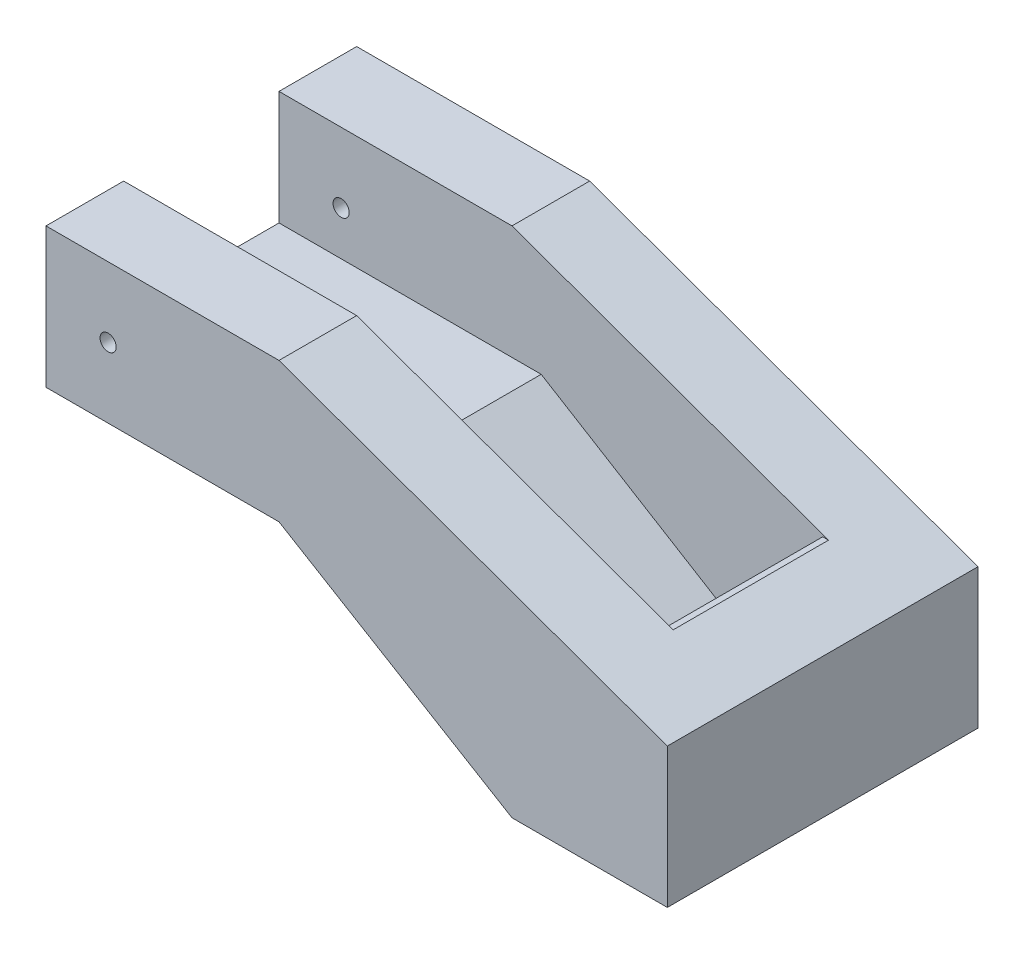
ISO-10303-21;
HEADER;
FILE_DESCRIPTION(('STEP AP214'),'2;1');
FILE_NAME('part.step','',(''),(''),'','','');
FILE_SCHEMA(('AUTOMOTIVE_DESIGN { 1 0 10303 214 1 1 1 1 }'));
ENDSEC;
DATA;
#1=APPLICATION_CONTEXT('core data for automotive mechanical design processes');
#2=APPLICATION_PROTOCOL_DEFINITION('international standard','automotive_design',2000,#1);
#3=PRODUCT_CONTEXT('',#1,'mechanical');
#4=PRODUCT('Part','Part','',(#3));
#5=PRODUCT_RELATED_PRODUCT_CATEGORY('part','',(#4));
#6=PRODUCT_DEFINITION_FORMATION('','',#4);
#7=PRODUCT_DEFINITION_CONTEXT('part definition',#1,'design');
#8=PRODUCT_DEFINITION('design','',#6,#7);
#9=PRODUCT_DEFINITION_SHAPE('','',#8);
#10=(LENGTH_UNIT() NAMED_UNIT(*) SI_UNIT(.MILLI.,.METRE.));
#11=(NAMED_UNIT(*) PLANE_ANGLE_UNIT() SI_UNIT($,.RADIAN.));
#12=(NAMED_UNIT(*) SI_UNIT($,.STERADIAN.) SOLID_ANGLE_UNIT());
#13=UNCERTAINTY_MEASURE_WITH_UNIT(LENGTH_MEASURE(1.E-05),#10,'distance_accuracy_value','');
#14=(GEOMETRIC_REPRESENTATION_CONTEXT(3) GLOBAL_UNCERTAINTY_ASSIGNED_CONTEXT((#13)) GLOBAL_UNIT_ASSIGNED_CONTEXT((#10,
#11,#12)) REPRESENTATION_CONTEXT('',''));
#15=CARTESIAN_POINT('',(0.,0.,0.));
#16=DIRECTION('',(0.,0.,1.));
#17=DIRECTION('',(1.,0.,0.));
#18=AXIS2_PLACEMENT_3D('',#15,#16,#17);
#19=CARTESIAN_POINT('',(127.,-80.4542904682652,190.5));
#20=DIRECTION('',(0.,-1.,0.));
#21=DIRECTION('',(1.,0.,0.));
#22=AXIS2_PLACEMENT_3D('',#19,#20,#21);
#23=PLANE('',#22);
#24=DIRECTION('',(0.,0.,-1.));
#25=VECTOR('',#24,1.);
#26=CARTESIAN_POINT('',(190.5,-80.4542904682652,190.5));
#27=LINE('',#26,#25);
#28=CARTESIAN_POINT('',(190.5,-80.4542904682652,190.5));
#29=VERTEX_POINT('',#28);
#30=CARTESIAN_POINT('',(190.5,-80.4542904682652,63.5));
#31=VERTEX_POINT('',#30);
#32=EDGE_CURVE('E283',#29,#31,#27,.T.);
#33=ORIENTED_EDGE('',*,*,#32,.T.);
#34=DIRECTION('',(1.,0.,0.));
#35=VECTOR('',#34,1.);
#36=CARTESIAN_POINT('',(127.,-80.4542904682652,63.5));
#37=LINE('',#36,#35);
#38=CARTESIAN_POINT('',(127.,-80.4542904682652,63.5));
#39=VERTEX_POINT('',#38);
#40=EDGE_CURVE('E248',#39,#31,#37,.T.);
#41=ORIENTED_EDGE('',*,*,#40,.F.);
#42=DIRECTION('',(0.,0.,-1.));
#43=VECTOR('',#42,1.);
#44=CARTESIAN_POINT('',(127.,-80.4542904682652,190.5));
#45=LINE('',#44,#43);
#46=CARTESIAN_POINT('',(127.,-80.4542904682652,190.5));
#47=VERTEX_POINT('',#46);
#48=EDGE_CURVE('E314',#47,#39,#45,.T.);
#49=ORIENTED_EDGE('',*,*,#48,.F.);
#50=DIRECTION('',(1.,0.,0.));
#51=VECTOR('',#50,1.);
#52=CARTESIAN_POINT('',(127.,-80.4542904682652,190.5));
#53=LINE('',#52,#51);
#54=EDGE_CURVE('E317',#47,#29,#53,.T.);
#55=ORIENTED_EDGE('',*,*,#54,.T.);
#56=EDGE_LOOP('',(#33,#41,#49,#55));
#57=FACE_BOUND('',#56,.T.);
#58=ADVANCED_FACE('F48',(#57),#23,.F.);
#59=CARTESIAN_POINT('',(-254.,114.3,254.));
#60=DIRECTION('',(1.,0.,0.));
#61=DIRECTION('',(0.,1.,0.));
#62=AXIS2_PLACEMENT_3D('',#59,#60,#61);
#63=PLANE('',#62);
#64=DIRECTION('',(0.,0.,1.));
#65=VECTOR('',#64,1.);
#66=CARTESIAN_POINT('',(-254.,0.,0.));
#67=LINE('',#66,#65);
#68=CARTESIAN_POINT('',(-254.,0.,0.));
#69=VERTEX_POINT('',#68);
#70=CARTESIAN_POINT('',(-254.,0.,254.));
#71=VERTEX_POINT('',#70);
#72=EDGE_CURVE('E251',#69,#71,#67,.T.);
#73=ORIENTED_EDGE('',*,*,#72,.T.);
#74=DIRECTION('',(0.,-1.,0.));
#75=VECTOR('',#74,1.);
#76=CARTESIAN_POINT('',(-254.,114.3,254.));
#77=LINE('',#76,#75);
#78=CARTESIAN_POINT('',(-254.,114.3,254.));
#79=VERTEX_POINT('',#78);
#80=EDGE_CURVE('E190',#79,#71,#77,.T.);
#81=ORIENTED_EDGE('',*,*,#80,.F.);
#82=DIRECTION('',(0.,0.,-1.));
#83=VECTOR('',#82,1.);
#84=CARTESIAN_POINT('',(-254.,114.3,254.));
#85=LINE('',#84,#83);
#86=CARTESIAN_POINT('',(-254.,114.3,190.5));
#87=VERTEX_POINT('',#86);
#88=EDGE_CURVE('E57',#79,#87,#85,.T.);
#89=ORIENTED_EDGE('',*,*,#88,.T.);
#90=DIRECTION('',(0.,1.,0.));
#91=VECTOR('',#90,1.);
#92=CARTESIAN_POINT('',(-254.,114.3,190.5));
#93=LINE('',#92,#91);
#94=CARTESIAN_POINT('',(-254.,21.1457095317347,190.5));
#95=VERTEX_POINT('',#94);
#96=EDGE_CURVE('E258',#95,#87,#93,.T.);
#97=ORIENTED_EDGE('',*,*,#96,.F.);
#98=DIRECTION('',(0.,0.,1.));
#99=VECTOR('',#98,1.);
#100=CARTESIAN_POINT('',(-254.,21.1457095317347,63.5));
#101=LINE('',#100,#99);
#102=CARTESIAN_POINT('',(-254.,21.1457095317347,63.5));
#103=VERTEX_POINT('',#102);
#104=EDGE_CURVE('E255',#103,#95,#101,.T.);
#105=ORIENTED_EDGE('',*,*,#104,.F.);
#106=DIRECTION('',(0.,-1.,0.));
#107=VECTOR('',#106,1.);
#108=CARTESIAN_POINT('',(-254.,114.3,63.5));
#109=LINE('',#108,#107);
#110=CARTESIAN_POINT('',(-254.,114.3,63.5));
#111=VERTEX_POINT('',#110);
#112=EDGE_CURVE('E223',#111,#103,#109,.T.);
#113=ORIENTED_EDGE('',*,*,#112,.F.);
#114=CARTESIAN_POINT('',(-254.,114.3,0.));
#115=VERTEX_POINT('',#114);
#116=EDGE_CURVE('E212',#111,#115,#85,.T.);
#117=ORIENTED_EDGE('',*,*,#116,.T.);
#118=DIRECTION('',(0.,-1.,0.));
#119=VECTOR('',#118,1.);
#120=CARTESIAN_POINT('',(-254.,114.3,0.));
#121=LINE('',#120,#119);
#122=EDGE_CURVE('E206',#115,#69,#121,.T.);
#123=ORIENTED_EDGE('',*,*,#122,.T.);
#124=EDGE_LOOP('',(#73,#81,#89,#97,#105,#113,#117,#123));
#125=FACE_BOUND('',#124,.T.);
#126=ADVANCED_FACE('F220',(#125),#63,.F.);
#127=CARTESIAN_POINT('',(0.,0.,254.));
#128=DIRECTION('',(0.,0.,1.));
#129=DIRECTION('',(1.,0.,0.));
#130=AXIS2_PLACEMENT_3D('',#127,#128,#129);
#131=PLANE('',#130);
#132=CARTESIAN_POINT('',(-203.2,57.1500000000001,254.));
#133=DIRECTION('',(0.,0.,1.));
#134=DIRECTION('',(1.,0.,0.));
#135=AXIS2_PLACEMENT_3D('',#132,#133,#134);
#136=CIRCLE('',#135,6.604);
#137=CARTESIAN_POINT('',(-196.596,57.1500000000001,254.));
#138=VERTEX_POINT('',#137);
#139=EDGE_CURVE('E452',#138,#138,#136,.T.);
#140=ORIENTED_EDGE('',*,*,#139,.F.);
#141=EDGE_LOOP('',(#140));
#142=FACE_BOUND('',#141,.T.);
#143=DIRECTION('',(0.940887411868727,-0.338719468272742,0.));
#144=VECTOR('',#143,1.);
#145=CARTESIAN_POINT('',(29.1416430594901,80.9490084985836,254.));
#146=LINE('',#145,#144);
#147=CARTESIAN_POINT('',(-63.5000000000001,114.3,254.));
#148=VERTEX_POINT('',#147);
#149=CARTESIAN_POINT('',(254.,0.,254.));
#150=VERTEX_POINT('',#149);
#151=EDGE_CURVE('E169',#148,#150,#146,.T.);
#152=ORIENTED_EDGE('',*,*,#151,.F.);
#153=DIRECTION('',(-1.,0.,0.));
#154=VECTOR('',#153,1.);
#155=CARTESIAN_POINT('',(-254.,114.3,254.));
#156=LINE('',#155,#154);
#157=EDGE_CURVE('E181',#148,#79,#156,.T.);
#158=ORIENTED_EDGE('',*,*,#157,.T.);
#159=ORIENTED_EDGE('',*,*,#80,.T.);
#160=DIRECTION('',(1.,0.,0.));
#161=VECTOR('',#160,1.);
#162=CARTESIAN_POINT('',(0.,0.,254.));
#163=LINE('',#162,#161);
#164=CARTESIAN_POINT('',(-63.5000000000001,0.,254.));
#165=VERTEX_POINT('',#164);
#166=EDGE_CURVE('E241',#71,#165,#163,.T.);
#167=ORIENTED_EDGE('',*,*,#166,.T.);
#168=DIRECTION('',(-0.857492925712544,0.514495755427526,0.));
#169=VECTOR('',#168,1.);
#170=CARTESIAN_POINT('',(-16.8088235294118,-28.0147058823529,254.));
#171=LINE('',#170,#169);
#172=CARTESIAN_POINT('',(127.,-114.3,254.));
#173=VERTEX_POINT('',#172);
#174=EDGE_CURVE('E245',#173,#165,#171,.T.);
#175=ORIENTED_EDGE('',*,*,#174,.F.);
#176=DIRECTION('',(1.,0.,0.));
#177=VECTOR('',#176,1.);
#178=CARTESIAN_POINT('',(-254.,-114.3,254.));
#179=LINE('',#178,#177);
#180=CARTESIAN_POINT('',(254.,-114.3,254.));
#181=VERTEX_POINT('',#180);
#182=EDGE_CURVE('E192',#173,#181,#179,.T.);
#183=ORIENTED_EDGE('',*,*,#182,.T.);
#184=DIRECTION('',(0.,1.,0.));
#185=VECTOR('',#184,1.);
#186=CARTESIAN_POINT('',(254.,114.3,254.));
#187=LINE('',#186,#185);
#188=EDGE_CURVE('E184',#181,#150,#187,.T.);
#189=ORIENTED_EDGE('',*,*,#188,.T.);
#190=EDGE_LOOP('',(#152,#158,#159,#167,#175,#183,#189));
#191=FACE_BOUND('',#190,.T.);
#192=ADVANCED_FACE('F179',(#142,#191),#131,.T.);
#193=CARTESIAN_POINT('',(0.,0.,0.));
#194=DIRECTION('',(0.,0.,1.));
#195=DIRECTION('',(1.,0.,0.));
#196=AXIS2_PLACEMENT_3D('',#193,#194,#195);
#197=PLANE('',#196);
#198=CARTESIAN_POINT('',(-203.2,57.1500000000001,0.));
#199=DIRECTION('',(0.,0.,1.));
#200=DIRECTION('',(1.,0.,0.));
#201=AXIS2_PLACEMENT_3D('',#198,#199,#200);
#202=CIRCLE('',#201,6.604);
#203=CARTESIAN_POINT('',(-196.596,57.1500000000001,0.));
#204=VERTEX_POINT('',#203);
#205=EDGE_CURVE('E185',#204,#204,#202,.T.);
#206=ORIENTED_EDGE('',*,*,#205,.T.);
#207=EDGE_LOOP('',(#206));
#208=FACE_BOUND('',#207,.T.);
#209=DIRECTION('',(-1.,0.,0.));
#210=VECTOR('',#209,1.);
#211=CARTESIAN_POINT('',(-254.,114.3,0.));
#212=LINE('',#211,#210);
#213=CARTESIAN_POINT('',(-63.5000000000001,114.3,0.));
#214=VERTEX_POINT('',#213);
#215=EDGE_CURVE('E203',#214,#115,#212,.T.);
#216=ORIENTED_EDGE('',*,*,#215,.F.);
#217=DIRECTION('',(0.940887411868727,-0.338719468272742,0.));
#218=VECTOR('',#217,1.);
#219=CARTESIAN_POINT('',(29.1416430594901,80.9490084985836,0.));
#220=LINE('',#219,#218);
#221=CARTESIAN_POINT('',(254.,0.,0.));
#222=VERTEX_POINT('',#221);
#223=EDGE_CURVE('E279',#214,#222,#220,.T.);
#224=ORIENTED_EDGE('',*,*,#223,.T.);
#225=DIRECTION('',(0.,1.,0.));
#226=VECTOR('',#225,1.);
#227=CARTESIAN_POINT('',(254.,114.3,0.));
#228=LINE('',#227,#226);
#229=CARTESIAN_POINT('',(254.,-114.3,0.));
#230=VERTEX_POINT('',#229);
#231=EDGE_CURVE('E200',#230,#222,#228,.T.);
#232=ORIENTED_EDGE('',*,*,#231,.F.);
#233=DIRECTION('',(1.,0.,0.));
#234=VECTOR('',#233,1.);
#235=CARTESIAN_POINT('',(-254.,-114.3,0.));
#236=LINE('',#235,#234);
#237=CARTESIAN_POINT('',(127.,-114.3,0.));
#238=VERTEX_POINT('',#237);
#239=EDGE_CURVE('E194',#238,#230,#236,.T.);
#240=ORIENTED_EDGE('',*,*,#239,.F.);
#241=DIRECTION('',(-0.857492925712544,0.514495755427526,0.));
#242=VECTOR('',#241,1.);
#243=CARTESIAN_POINT('',(-16.8088235294118,-28.0147058823529,0.));
#244=LINE('',#243,#242);
#245=CARTESIAN_POINT('',(-63.5000000000001,0.,0.));
#246=VERTEX_POINT('',#245);
#247=EDGE_CURVE('E235',#238,#246,#244,.T.);
#248=ORIENTED_EDGE('',*,*,#247,.T.);
#249=DIRECTION('',(1.,0.,0.));
#250=VECTOR('',#249,1.);
#251=CARTESIAN_POINT('',(0.,0.,0.));
#252=LINE('',#251,#250);
#253=EDGE_CURVE('E233',#69,#246,#252,.T.);
#254=ORIENTED_EDGE('',*,*,#253,.F.);
#255=ORIENTED_EDGE('',*,*,#122,.F.);
#256=EDGE_LOOP('',(#216,#224,#232,#240,#248,#254,#255));
#257=FACE_BOUND('',#256,.T.);
#258=ADVANCED_FACE('F229',(#208,#257),#197,.F.);
#259=CARTESIAN_POINT('',(-254.,114.3,254.));
#260=DIRECTION('',(0.,-1.,0.));
#261=DIRECTION('',(0.,0.,-1.));
#262=AXIS2_PLACEMENT_3D('',#259,#260,#261);
#263=PLANE('',#262);
#264=ORIENTED_EDGE('',*,*,#157,.F.);
#265=DIRECTION('',(0.,0.,1.));
#266=VECTOR('',#265,1.);
#267=CARTESIAN_POINT('',(-63.5000000000001,114.3,-61.9760000000002));
#268=LINE('',#267,#266);
#269=CARTESIAN_POINT('',(-63.5000000000001,114.3,190.5));
#270=VERTEX_POINT('',#269);
#271=EDGE_CURVE('E166',#270,#148,#268,.T.);
#272=ORIENTED_EDGE('',*,*,#271,.F.);
#273=DIRECTION('',(-1.,0.,0.));
#274=VECTOR('',#273,1.);
#275=CARTESIAN_POINT('',(254.,114.3,190.5));
#276=LINE('',#275,#274);
#277=EDGE_CURVE('E204',#270,#87,#276,.T.);
#278=ORIENTED_EDGE('',*,*,#277,.T.);
#279=ORIENTED_EDGE('',*,*,#88,.F.);
#280=EDGE_LOOP('',(#264,#272,#278,#279));
#281=FACE_BOUND('',#280,.T.);
#282=ADVANCED_FACE('F187',(#281),#263,.F.);
#283=CARTESIAN_POINT('',(254.,114.3,254.));
#284=DIRECTION('',(-1.,0.,0.));
#285=DIRECTION('',(0.,-1.,0.));
#286=AXIS2_PLACEMENT_3D('',#283,#284,#285);
#287=PLANE('',#286);
#288=ORIENTED_EDGE('',*,*,#231,.T.);
#289=DIRECTION('',(0.,0.,1.));
#290=VECTOR('',#289,1.);
#291=CARTESIAN_POINT('',(254.,0.,-61.9760000000002));
#292=LINE('',#291,#290);
#293=EDGE_CURVE('E274',#222,#150,#292,.T.);
#294=ORIENTED_EDGE('',*,*,#293,.T.);
#295=ORIENTED_EDGE('',*,*,#188,.F.);
#296=DIRECTION('',(0.,0.,-1.));
#297=VECTOR('',#296,1.);
#298=CARTESIAN_POINT('',(254.,-114.3,254.));
#299=LINE('',#298,#297);
#300=EDGE_CURVE('E199',#181,#230,#299,.T.);
#301=ORIENTED_EDGE('',*,*,#300,.T.);
#302=EDGE_LOOP('',(#288,#294,#295,#301));
#303=FACE_BOUND('',#302,.T.);
#304=ADVANCED_FACE('F50',(#303),#287,.F.);
#305=DIRECTION('',(-1.,0.,0.));
#306=VECTOR('',#305,1.);
#307=CARTESIAN_POINT('',(254.,114.3,63.5));
#308=LINE('',#307,#306);
#309=CARTESIAN_POINT('',(-63.5000000000001,114.3,63.5));
#310=VERTEX_POINT('',#309);
#311=EDGE_CURVE('E261',#310,#111,#308,.T.);
#312=ORIENTED_EDGE('',*,*,#311,.F.);
#313=EDGE_CURVE('E175',#214,#310,#268,.T.);
#314=ORIENTED_EDGE('',*,*,#313,.F.);
#315=ORIENTED_EDGE('',*,*,#215,.T.);
#316=ORIENTED_EDGE('',*,*,#116,.F.);
#317=EDGE_LOOP('',(#312,#314,#315,#316));
#318=FACE_BOUND('',#317,.T.);
#319=ADVANCED_FACE('F273',(#318),#263,.F.);
#320=CARTESIAN_POINT('',(-254.,-114.3,254.));
#321=DIRECTION('',(0.,1.,0.));
#322=DIRECTION('',(0.,0.,1.));
#323=AXIS2_PLACEMENT_3D('',#320,#321,#322);
#324=PLANE('',#323);
#325=ORIENTED_EDGE('',*,*,#182,.F.);
#326=DIRECTION('',(0.,0.,1.));
#327=VECTOR('',#326,1.);
#328=CARTESIAN_POINT('',(127.,-114.3,0.));
#329=LINE('',#328,#327);
#330=EDGE_CURVE('E237',#238,#173,#329,.T.);
#331=ORIENTED_EDGE('',*,*,#330,.F.);
#332=ORIENTED_EDGE('',*,*,#239,.T.);
#333=ORIENTED_EDGE('',*,*,#300,.F.);
#334=EDGE_LOOP('',(#325,#331,#332,#333));
#335=FACE_BOUND('',#334,.T.);
#336=ADVANCED_FACE('F377',(#335),#324,.F.);
#337=CARTESIAN_POINT('',(254.,114.3,190.5));
#338=DIRECTION('',(0.,0.,1.));
#339=DIRECTION('',(1.,0.,0.));
#340=AXIS2_PLACEMENT_3D('',#337,#338,#339);
#341=PLANE('',#340);
#342=CARTESIAN_POINT('',(-203.2,57.1500000000001,190.5));
#343=DIRECTION('',(0.,0.,1.));
#344=DIRECTION('',(1.,0.,0.));
#345=AXIS2_PLACEMENT_3D('',#342,#343,#344);
#346=CIRCLE('',#345,6.604);
#347=CARTESIAN_POINT('',(-196.596,57.1500000000001,190.5));
#348=VERTEX_POINT('',#347);
#349=EDGE_CURVE('E455',#348,#348,#346,.T.);
#350=ORIENTED_EDGE('',*,*,#349,.T.);
#351=EDGE_LOOP('',(#350));
#352=FACE_BOUND('',#351,.T.);
#353=ORIENTED_EDGE('',*,*,#277,.F.);
#354=DIRECTION('',(0.940887411868727,-0.338719468272742,0.));
#355=VECTOR('',#354,1.);
#356=CARTESIAN_POINT('',(217.572946175637,13.1137393767706,190.5));
#357=LINE('',#356,#355);
#358=CARTESIAN_POINT('',(195.261917967404,21.1457095317347,190.5));
#359=VERTEX_POINT('',#358);
#360=EDGE_CURVE('E171',#270,#359,#357,.T.);
#361=ORIENTED_EDGE('',*,*,#360,.T.);
#362=DIRECTION('',(1.,0.,0.));
#363=VECTOR('',#362,1.);
#364=CARTESIAN_POINT('',(190.5,21.1457095317347,190.5));
#365=LINE('',#364,#363);
#366=CARTESIAN_POINT('',(190.5,21.1457095317347,190.5));
#367=VERTEX_POINT('',#366);
#368=EDGE_CURVE('E71',#367,#359,#365,.T.);
#369=ORIENTED_EDGE('',*,*,#368,.F.);
#370=DIRECTION('',(0.,-1.,0.));
#371=VECTOR('',#370,1.);
#372=CARTESIAN_POINT('',(190.5,21.1457095317347,190.5));
#373=LINE('',#372,#371);
#374=EDGE_CURVE('E281',#367,#29,#373,.T.);
#375=ORIENTED_EDGE('',*,*,#374,.T.);
#376=ORIENTED_EDGE('',*,*,#54,.F.);
#377=DIRECTION('',(0.,-1.,0.));
#378=VECTOR('',#377,1.);
#379=CARTESIAN_POINT('',(127.,21.1457095317348,190.5));
#380=LINE('',#379,#378);
#381=CARTESIAN_POINT('',(127.,21.1457095317348,190.5));
#382=VERTEX_POINT('',#381);
#383=EDGE_CURVE('E312',#382,#47,#380,.T.);
#384=ORIENTED_EDGE('',*,*,#383,.F.);
#385=DIRECTION('',(-1.,0.,0.));
#386=VECTOR('',#385,1.);
#387=CARTESIAN_POINT('',(254.,21.1457095317348,190.5));
#388=LINE('',#387,#386);
#389=CARTESIAN_POINT('',(-39.624,21.1457095317348,190.5));
#390=VERTEX_POINT('',#389);
#391=EDGE_CURVE('E263',#382,#390,#388,.T.);
#392=ORIENTED_EDGE('',*,*,#391,.T.);
#393=EDGE_CURVE('E266',#390,#95,#388,.T.);
#394=ORIENTED_EDGE('',*,*,#393,.T.);
#395=ORIENTED_EDGE('',*,*,#96,.T.);
#396=EDGE_LOOP('',(#353,#361,#369,#375,#376,#384,#392,#394,#395));
#397=FACE_BOUND('',#396,.T.);
#398=ADVANCED_FACE('F333',(#352,#397),#341,.F.);
#399=CARTESIAN_POINT('',(254.,21.1457095317348,63.5));
#400=DIRECTION('',(0.,-1.,0.));
#401=DIRECTION('',(1.,0.,0.));
#402=AXIS2_PLACEMENT_3D('',#399,#400,#401);
#403=PLANE('',#402);
#404=ORIENTED_EDGE('',*,*,#393,.F.);
#405=DIRECTION('',(0.,0.,1.));
#406=VECTOR('',#405,1.);
#407=CARTESIAN_POINT('',(-39.624,21.1457095317348,63.5));
#408=LINE('',#407,#406);
#409=CARTESIAN_POINT('',(-39.624,21.1457095317348,63.5));
#410=VERTEX_POINT('',#409);
#411=EDGE_CURVE('E307',#410,#390,#408,.T.);
#412=ORIENTED_EDGE('',*,*,#411,.F.);
#413=DIRECTION('',(-1.,0.,0.));
#414=VECTOR('',#413,1.);
#415=CARTESIAN_POINT('',(254.,21.1457095317348,63.5));
#416=LINE('',#415,#414);
#417=EDGE_CURVE('E267',#410,#103,#416,.T.);
#418=ORIENTED_EDGE('',*,*,#417,.T.);
#419=ORIENTED_EDGE('',*,*,#104,.T.);
#420=EDGE_LOOP('',(#404,#412,#418,#419));
#421=FACE_BOUND('',#420,.T.);
#422=ADVANCED_FACE('F336',(#421),#403,.F.);
#423=CARTESIAN_POINT('',(254.,114.3,63.5));
#424=DIRECTION('',(0.,0.,-1.));
#425=DIRECTION('',(-1.,0.,0.));
#426=AXIS2_PLACEMENT_3D('',#423,#424,#425);
#427=PLANE('',#426);
#428=CARTESIAN_POINT('',(-203.2,57.1500000000001,63.5));
#429=DIRECTION('',(0.,0.,-1.));
#430=DIRECTION('',(-1.,0.,0.));
#431=AXIS2_PLACEMENT_3D('',#428,#429,#430);
#432=CIRCLE('',#431,6.604);
#433=CARTESIAN_POINT('',(-209.804,57.1500000000001,63.5));
#434=VERTEX_POINT('',#433);
#435=EDGE_CURVE('E52',#434,#434,#432,.T.);
#436=ORIENTED_EDGE('',*,*,#435,.T.);
#437=EDGE_LOOP('',(#436));
#438=FACE_BOUND('',#437,.T.);
#439=DIRECTION('',(1.,0.,0.));
#440=VECTOR('',#439,1.);
#441=CARTESIAN_POINT('',(190.5,21.1457095317347,63.5));
#442=LINE('',#441,#440);
#443=CARTESIAN_POINT('',(190.5,21.1457095317347,63.5));
#444=VERTEX_POINT('',#443);
#445=CARTESIAN_POINT('',(195.261917967404,21.1457095317347,63.5));
#446=VERTEX_POINT('',#445);
#447=EDGE_CURVE('E290',#444,#446,#442,.T.);
#448=ORIENTED_EDGE('',*,*,#447,.T.);
#449=DIRECTION('',(-0.940887411868727,0.338719468272742,0.));
#450=VECTOR('',#449,1.);
#451=CARTESIAN_POINT('',(217.572946175637,13.1137393767706,63.5));
#452=LINE('',#451,#450);
#453=EDGE_CURVE('E63',#446,#310,#452,.T.);
#454=ORIENTED_EDGE('',*,*,#453,.T.);
#455=ORIENTED_EDGE('',*,*,#311,.T.);
#456=ORIENTED_EDGE('',*,*,#112,.T.);
#457=ORIENTED_EDGE('',*,*,#417,.F.);
#458=DIRECTION('',(0.853796175794036,-0.520607424264656,0.));
#459=VECTOR('',#458,1.);
#460=CARTESIAN_POINT('',(-39.624,21.1457095317348,63.5));
#461=LINE('',#460,#459);
#462=EDGE_CURVE('E302',#410,#39,#461,.T.);
#463=ORIENTED_EDGE('',*,*,#462,.T.);
#464=ORIENTED_EDGE('',*,*,#40,.T.);
#465=DIRECTION('',(0.,1.,0.));
#466=VECTOR('',#465,1.);
#467=CARTESIAN_POINT('',(190.5,-80.4542904682652,63.5));
#468=LINE('',#467,#466);
#469=EDGE_CURVE('E285',#31,#444,#468,.T.);
#470=ORIENTED_EDGE('',*,*,#469,.T.);
#471=EDGE_LOOP('',(#448,#454,#455,#456,#457,#463,#464,#470));
#472=FACE_BOUND('',#471,.T.);
#473=ADVANCED_FACE('F270',(#438,#472),#427,.F.);
#474=CARTESIAN_POINT('',(0.,0.,0.));
#475=DIRECTION('',(0.,-1.,0.));
#476=DIRECTION('',(1.,0.,0.));
#477=AXIS2_PLACEMENT_3D('',#474,#475,#476);
#478=PLANE('',#477);
#479=ORIENTED_EDGE('',*,*,#166,.F.);
#480=ORIENTED_EDGE('',*,*,#72,.F.);
#481=ORIENTED_EDGE('',*,*,#253,.T.);
#482=DIRECTION('',(0.,0.,1.));
#483=VECTOR('',#482,1.);
#484=CARTESIAN_POINT('',(-63.5000000000001,0.,0.));
#485=LINE('',#484,#483);
#486=EDGE_CURVE('E239',#246,#165,#485,.T.);
#487=ORIENTED_EDGE('',*,*,#486,.T.);
#488=EDGE_LOOP('',(#479,#480,#481,#487));
#489=FACE_BOUND('',#488,.T.);
#490=ADVANCED_FACE('F368',(#489),#478,.T.);
#491=CARTESIAN_POINT('',(-16.8088235294118,-28.0147058823529,0.));
#492=DIRECTION('',(0.514495755427527,0.857492925712544,0.));
#493=DIRECTION('',(-0.857492925712544,0.514495755427527,0.));
#494=AXIS2_PLACEMENT_3D('',#491,#492,#493);
#495=PLANE('',#494);
#496=ORIENTED_EDGE('',*,*,#174,.T.);
#497=ORIENTED_EDGE('',*,*,#486,.F.);
#498=ORIENTED_EDGE('',*,*,#247,.F.);
#499=ORIENTED_EDGE('',*,*,#330,.T.);
#500=EDGE_LOOP('',(#496,#497,#498,#499));
#501=FACE_BOUND('',#500,.T.);
#502=ADVANCED_FACE('F371',(#501),#495,.F.);
#503=CARTESIAN_POINT('',(127.,21.1457095317348,63.5));
#504=DIRECTION('',(-1.,0.,0.));
#505=DIRECTION('',(0.,0.,1.));
#506=AXIS2_PLACEMENT_3D('',#503,#504,#505);
#507=PLANE('',#506);
#508=ORIENTED_EDGE('',*,*,#383,.T.);
#509=DIRECTION('',(0.,0.,1.));
#510=VECTOR('',#509,1.);
#511=CARTESIAN_POINT('',(127.,-80.4542904682652,63.5));
#512=LINE('',#511,#510);
#513=CARTESIAN_POINT('',(127.,-80.4542904682652,190.754));
#514=VERTEX_POINT('',#513);
#515=EDGE_CURVE('E310',#47,#514,#512,.T.);
#516=ORIENTED_EDGE('',*,*,#515,.T.);
#517=DIRECTION('',(0.,-1.,0.));
#518=VECTOR('',#517,1.);
#519=CARTESIAN_POINT('',(127.,21.1457095317348,190.754));
#520=LINE('',#519,#518);
#521=CARTESIAN_POINT('',(127.,21.1457095317348,190.754));
#522=VERTEX_POINT('',#521);
#523=EDGE_CURVE('E292',#522,#514,#520,.T.);
#524=ORIENTED_EDGE('',*,*,#523,.F.);
#525=DIRECTION('',(0.,0.,1.));
#526=VECTOR('',#525,1.);
#527=CARTESIAN_POINT('',(127.,21.1457095317348,63.5));
#528=LINE('',#527,#526);
#529=EDGE_CURVE('E304',#382,#522,#528,.T.);
#530=ORIENTED_EDGE('',*,*,#529,.F.);
#531=EDGE_LOOP('',(#508,#516,#524,#530));
#532=FACE_BOUND('',#531,.T.);
#533=ADVANCED_FACE('F344',(#532),#507,.T.);
#534=CARTESIAN_POINT('',(127.,21.1457095317348,63.5));
#535=DIRECTION('',(0.,1.,0.));
#536=DIRECTION('',(0.,0.,1.));
#537=AXIS2_PLACEMENT_3D('',#534,#535,#536);
#538=PLANE('',#537);
#539=ORIENTED_EDGE('',*,*,#529,.T.);
#540=DIRECTION('',(-1.,0.,0.));
#541=VECTOR('',#540,1.);
#542=CARTESIAN_POINT('',(127.,21.1457095317348,190.754));
#543=LINE('',#542,#541);
#544=CARTESIAN_POINT('',(-39.624,21.1457095317348,190.754));
#545=VERTEX_POINT('',#544);
#546=EDGE_CURVE('E299',#522,#545,#543,.T.);
#547=ORIENTED_EDGE('',*,*,#546,.T.);
#548=EDGE_CURVE('E306',#390,#545,#408,.T.);
#549=ORIENTED_EDGE('',*,*,#548,.F.);
#550=ORIENTED_EDGE('',*,*,#391,.F.);
#551=EDGE_LOOP('',(#539,#547,#549,#550));
#552=FACE_BOUND('',#551,.T.);
#553=ADVANCED_FACE('F347',(#552),#538,.F.);
#554=CARTESIAN_POINT('',(-39.624,21.1457095317348,63.5));
#555=DIRECTION('',(-0.520607424264656,-0.853796175794036,0.));
#556=DIRECTION('',(0.853796175794036,-0.520607424264656,0.));
#557=AXIS2_PLACEMENT_3D('',#554,#555,#556);
#558=PLANE('',#557);
#559=ORIENTED_EDGE('',*,*,#48,.T.);
#560=ORIENTED_EDGE('',*,*,#462,.F.);
#561=ORIENTED_EDGE('',*,*,#411,.T.);
#562=ORIENTED_EDGE('',*,*,#548,.T.);
#563=DIRECTION('',(0.853796175794036,-0.520607424264656,0.));
#564=VECTOR('',#563,1.);
#565=CARTESIAN_POINT('',(-39.624,21.1457095317348,190.754));
#566=LINE('',#565,#564);
#567=EDGE_CURVE('E296',#545,#514,#566,.T.);
#568=ORIENTED_EDGE('',*,*,#567,.T.);
#569=ORIENTED_EDGE('',*,*,#515,.F.);
#570=EDGE_LOOP('',(#559,#560,#561,#562,#568,#569));
#571=FACE_BOUND('',#570,.T.);
#572=ADVANCED_FACE('F340',(#571),#558,.F.);
#573=CARTESIAN_POINT('',(0.,0.,190.754));
#574=DIRECTION('',(0.,0.,-1.));
#575=DIRECTION('',(-1.,0.,0.));
#576=AXIS2_PLACEMENT_3D('',#573,#574,#575);
#577=PLANE('',#576);
#578=ORIENTED_EDGE('',*,*,#523,.T.);
#579=ORIENTED_EDGE('',*,*,#567,.F.);
#580=ORIENTED_EDGE('',*,*,#546,.F.);
#581=EDGE_LOOP('',(#578,#579,#580));
#582=FACE_BOUND('',#581,.T.);
#583=ADVANCED_FACE('F350',(#582),#577,.T.);
#584=CARTESIAN_POINT('',(190.5,21.1457095317347,190.5));
#585=DIRECTION('',(0.,1.,0.));
#586=DIRECTION('',(-1.,0.,0.));
#587=AXIS2_PLACEMENT_3D('',#584,#585,#586);
#588=PLANE('',#587);
#589=DIRECTION('',(0.,0.,1.));
#590=VECTOR('',#589,1.);
#591=CARTESIAN_POINT('',(195.261917967404,21.1457095317347,190.5));
#592=LINE('',#591,#590);
#593=EDGE_CURVE('E13',#446,#359,#592,.T.);
#594=ORIENTED_EDGE('',*,*,#593,.F.);
#595=ORIENTED_EDGE('',*,*,#447,.F.);
#596=DIRECTION('',(0.,0.,1.));
#597=VECTOR('',#596,1.);
#598=CARTESIAN_POINT('',(190.5,21.1457095317347,190.5));
#599=LINE('',#598,#597);
#600=EDGE_CURVE('E287',#444,#367,#599,.T.);
#601=ORIENTED_EDGE('',*,*,#600,.T.);
#602=ORIENTED_EDGE('',*,*,#368,.T.);
#603=EDGE_LOOP('',(#594,#595,#601,#602));
#604=FACE_BOUND('',#603,.T.);
#605=ADVANCED_FACE('F332',(#604),#588,.T.);
#606=CARTESIAN_POINT('',(190.5,0.,0.));
#607=DIRECTION('',(1.,0.,0.));
#608=DIRECTION('',(0.,0.,-1.));
#609=AXIS2_PLACEMENT_3D('',#606,#607,#608);
#610=PLANE('',#609);
#611=ORIENTED_EDGE('',*,*,#374,.F.);
#612=ORIENTED_EDGE('',*,*,#600,.F.);
#613=ORIENTED_EDGE('',*,*,#469,.F.);
#614=ORIENTED_EDGE('',*,*,#32,.F.);
#615=EDGE_LOOP('',(#611,#612,#613,#614));
#616=FACE_BOUND('',#615,.T.);
#617=ADVANCED_FACE('F328',(#616),#610,.F.);
#618=CARTESIAN_POINT('',(29.1416430594901,80.9490084985836,-61.9760000000002));
#619=DIRECTION('',(-0.338719468272742,-0.940887411868727,0.));
#620=DIRECTION('',(0.940887411868727,-0.338719468272742,0.));
#621=AXIS2_PLACEMENT_3D('',#618,#619,#620);
#622=PLANE('',#621);
#623=ORIENTED_EDGE('',*,*,#313,.T.);
#624=ORIENTED_EDGE('',*,*,#453,.F.);
#625=ORIENTED_EDGE('',*,*,#593,.T.);
#626=ORIENTED_EDGE('',*,*,#360,.F.);
#627=ORIENTED_EDGE('',*,*,#271,.T.);
#628=ORIENTED_EDGE('',*,*,#151,.T.);
#629=ORIENTED_EDGE('',*,*,#293,.F.);
#630=ORIENTED_EDGE('',*,*,#223,.F.);
#631=EDGE_LOOP('',(#623,#624,#625,#626,#627,#628,#629,#630));
#632=FACE_BOUND('',#631,.T.);
#633=ADVANCED_FACE('F168',(#632),#622,.F.);
#634=CARTESIAN_POINT('',(-203.2,57.1500000000001,-61.9760000000002));
#635=DIRECTION('',(0.,0.,1.));
#636=DIRECTION('',(1.,0.,0.));
#637=AXIS2_PLACEMENT_3D('',#634,#635,#636);
#638=CYLINDRICAL_SURFACE('',#637,6.604);
#639=ORIENTED_EDGE('',*,*,#435,.F.);
#640=EDGE_LOOP('',(#639));
#641=FACE_BOUND('',#640,.T.);
#642=ORIENTED_EDGE('',*,*,#205,.F.);
#643=EDGE_LOOP('',(#642));
#644=FACE_BOUND('',#643,.T.);
#645=ADVANCED_FACE('F430',(#641,#644),#638,.F.);
#646=ORIENTED_EDGE('',*,*,#139,.T.);
#647=EDGE_LOOP('',(#646));
#648=FACE_BOUND('',#647,.T.);
#649=ORIENTED_EDGE('',*,*,#349,.F.);
#650=EDGE_LOOP('',(#649));
#651=FACE_BOUND('',#650,.T.);
#652=ADVANCED_FACE('F440',(#648,#651),#638,.F.);
#653=CLOSED_SHELL('',(#58,#126,#192,#258,#282,#304,#319,#336,#398,#422,#473,#490,#502,#533,#553,
#572,#583,#605,#617,#633,#645,#652));
#654=MANIFOLD_SOLID_BREP('B2',#653);
#655=ADVANCED_BREP_SHAPE_REPRESENTATION('',(#18,#654),#14);
#656=SHAPE_DEFINITION_REPRESENTATION(#9,#655);
ENDSEC;
END-ISO-10303-21;
